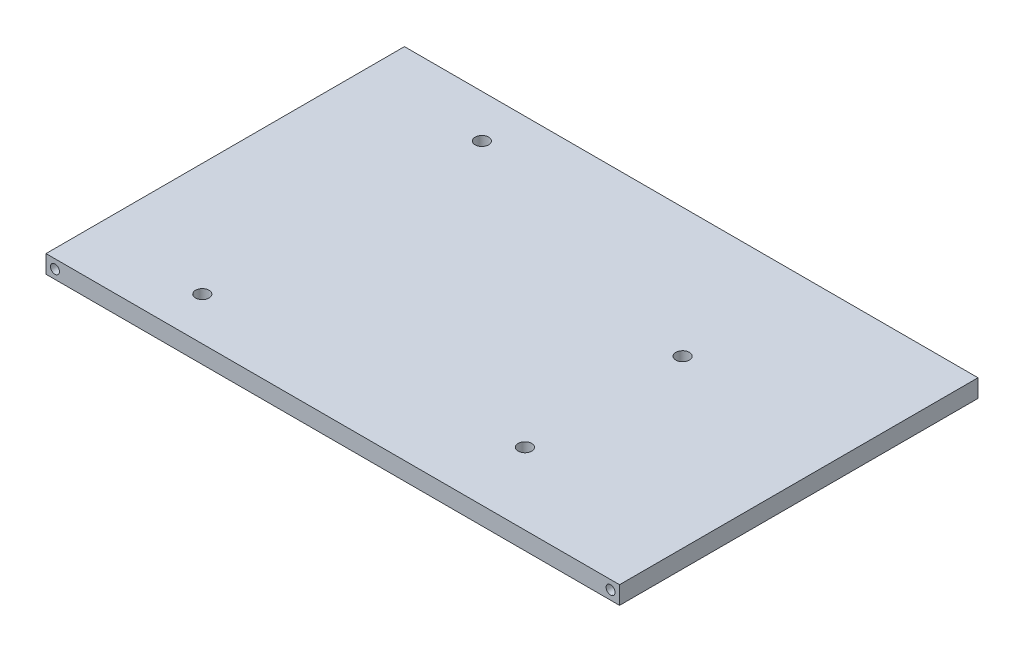
ISO-10303-21;
HEADER;
FILE_DESCRIPTION(('STEP AP214'),'2;1');
FILE_NAME('part.step','',(''),(''),'','','');
FILE_SCHEMA(('AUTOMOTIVE_DESIGN { 1 0 10303 214 1 1 1 1 }'));
ENDSEC;
DATA;
#1=APPLICATION_CONTEXT('core data for automotive mechanical design processes');
#2=APPLICATION_PROTOCOL_DEFINITION('international standard','automotive_design',2000,#1);
#3=PRODUCT_CONTEXT('',#1,'mechanical');
#4=PRODUCT('Part','Part','',(#3));
#5=PRODUCT_RELATED_PRODUCT_CATEGORY('part','',(#4));
#6=PRODUCT_DEFINITION_FORMATION('','',#4);
#7=PRODUCT_DEFINITION_CONTEXT('part definition',#1,'design');
#8=PRODUCT_DEFINITION('design','',#6,#7);
#9=PRODUCT_DEFINITION_SHAPE('','',#8);
#10=(LENGTH_UNIT() NAMED_UNIT(*) SI_UNIT(.MILLI.,.METRE.));
#11=(NAMED_UNIT(*) PLANE_ANGLE_UNIT() SI_UNIT($,.RADIAN.));
#12=(NAMED_UNIT(*) SI_UNIT($,.STERADIAN.) SOLID_ANGLE_UNIT());
#13=UNCERTAINTY_MEASURE_WITH_UNIT(LENGTH_MEASURE(1.E-05),#10,'distance_accuracy_value','');
#14=(GEOMETRIC_REPRESENTATION_CONTEXT(3) GLOBAL_UNCERTAINTY_ASSIGNED_CONTEXT((#13)) GLOBAL_UNIT_ASSIGNED_CONTEXT((#10,
#11,#12)) REPRESENTATION_CONTEXT('',''));
#15=CARTESIAN_POINT('',(0.,0.,0.));
#16=DIRECTION('',(0.,0.,1.));
#17=DIRECTION('',(1.,0.,0.));
#18=AXIS2_PLACEMENT_3D('',#15,#16,#17);
#19=CARTESIAN_POINT('',(-42.2044454578592,3.175,-20.6541242768741));
#20=DIRECTION('',(1.,0.,0.));
#21=DIRECTION('',(0.,0.,-1.));
#22=AXIS2_PLACEMENT_3D('',#19,#20,#21);
#23=PLANE('',#22);
#24=DIRECTION('',(0.,0.,1.));
#25=VECTOR('',#24,1.);
#26=CARTESIAN_POINT('',(-42.2044454578592,0.,-20.6541242768741));
#27=LINE('',#26,#25);
#28=CARTESIAN_POINT('',(-42.2044454578592,0.,-20.6541242768741));
#29=VERTEX_POINT('',#28);
#30=CARTESIAN_POINT('',(-42.2044454578592,0.,42.8458757231259));
#31=VERTEX_POINT('',#30);
#32=EDGE_CURVE('E95',#29,#31,#27,.T.);
#33=ORIENTED_EDGE('',*,*,#32,.T.);
#34=DIRECTION('',(0.,-1.,0.));
#35=VECTOR('',#34,1.);
#36=CARTESIAN_POINT('',(-42.2044454578592,3.175,42.8458757231259));
#37=LINE('',#36,#35);
#38=CARTESIAN_POINT('',(-42.2044454578592,3.175,42.8458757231259));
#39=VERTEX_POINT('',#38);
#40=EDGE_CURVE('E11',#39,#31,#37,.T.);
#41=ORIENTED_EDGE('',*,*,#40,.F.);
#42=DIRECTION('',(0.,0.,1.));
#43=VECTOR('',#42,1.);
#44=CARTESIAN_POINT('',(-42.2044454578592,3.175,-20.6541242768741));
#45=LINE('',#44,#43);
#46=CARTESIAN_POINT('',(-42.2044454578592,3.175,-20.6541242768741));
#47=VERTEX_POINT('',#46);
#48=EDGE_CURVE('E83',#47,#39,#45,.T.);
#49=ORIENTED_EDGE('',*,*,#48,.F.);
#50=DIRECTION('',(0.,-1.,0.));
#51=VECTOR('',#50,1.);
#52=CARTESIAN_POINT('',(-42.2044454578592,3.175,-20.6541242768741));
#53=LINE('',#52,#51);
#54=EDGE_CURVE('E91',#47,#29,#53,.T.);
#55=ORIENTED_EDGE('',*,*,#54,.T.);
#56=EDGE_LOOP('',(#33,#41,#49,#55));
#57=FACE_BOUND('',#56,.T.);
#58=ADVANCED_FACE('F32',(#57),#23,.F.);
#59=CARTESIAN_POINT('',(-42.2044454578592,3.175,42.8458757231259));
#60=DIRECTION('',(0.,0.,-1.));
#61=DIRECTION('',(-1.,0.,0.));
#62=AXIS2_PLACEMENT_3D('',#59,#60,#61);
#63=PLANE('',#62);
#64=CARTESIAN_POINT('',(57.8080545421408,1.5875,42.8458757231259));
#65=DIRECTION('',(0.,0.,1.));
#66=DIRECTION('',(1.,0.,0.));
#67=AXIS2_PLACEMENT_3D('',#64,#65,#66);
#68=CIRCLE('',#67,0.79375);
#69=CARTESIAN_POINT('',(58.6018045421408,1.5875,42.8458757231259));
#70=VERTEX_POINT('',#69);
#71=EDGE_CURVE('E115',#70,#70,#68,.T.);
#72=ORIENTED_EDGE('',*,*,#71,.F.);
#73=EDGE_LOOP('',(#72));
#74=FACE_BOUND('',#73,.T.);
#75=CARTESIAN_POINT('',(-40.6169454578592,1.5875,42.8458757231259));
#76=DIRECTION('',(0.,0.,1.));
#77=DIRECTION('',(1.,0.,0.));
#78=AXIS2_PLACEMENT_3D('',#75,#76,#77);
#79=CIRCLE('',#78,0.79375);
#80=CARTESIAN_POINT('',(-39.8231954578592,1.5875,42.8458757231259));
#81=VERTEX_POINT('',#80);
#82=EDGE_CURVE('E109',#81,#81,#79,.T.);
#83=ORIENTED_EDGE('',*,*,#82,.F.);
#84=EDGE_LOOP('',(#83));
#85=FACE_BOUND('',#84,.T.);
#86=DIRECTION('',(1.,0.,0.));
#87=VECTOR('',#86,1.);
#88=CARTESIAN_POINT('',(-42.2044454578592,0.,42.8458757231259));
#89=LINE('',#88,#87);
#90=CARTESIAN_POINT('',(59.3955545421408,0.,42.8458757231259));
#91=VERTEX_POINT('',#90);
#92=EDGE_CURVE('E87',#31,#91,#89,.T.);
#93=ORIENTED_EDGE('',*,*,#92,.T.);
#94=DIRECTION('',(0.,-1.,0.));
#95=VECTOR('',#94,1.);
#96=CARTESIAN_POINT('',(59.3955545421408,3.175,42.8458757231259));
#97=LINE('',#96,#95);
#98=CARTESIAN_POINT('',(59.3955545421408,3.175,42.8458757231259));
#99=VERTEX_POINT('',#98);
#100=EDGE_CURVE('E40',#99,#91,#97,.T.);
#101=ORIENTED_EDGE('',*,*,#100,.F.);
#102=DIRECTION('',(1.,0.,0.));
#103=VECTOR('',#102,1.);
#104=CARTESIAN_POINT('',(-42.2044454578592,3.175,42.8458757231259));
#105=LINE('',#104,#103);
#106=EDGE_CURVE('E78',#39,#99,#105,.T.);
#107=ORIENTED_EDGE('',*,*,#106,.F.);
#108=ORIENTED_EDGE('',*,*,#40,.T.);
#109=EDGE_LOOP('',(#93,#101,#107,#108));
#110=FACE_BOUND('',#109,.T.);
#111=ADVANCED_FACE('F86',(#74,#85,#110),#63,.F.);
#112=CARTESIAN_POINT('',(59.3955545421408,3.175,-20.6541242768741));
#113=DIRECTION('',(-1.,0.,0.));
#114=DIRECTION('',(0.,0.,1.));
#115=AXIS2_PLACEMENT_3D('',#112,#113,#114);
#116=PLANE('',#115);
#117=DIRECTION('',(0.,0.,-1.));
#118=VECTOR('',#117,1.);
#119=CARTESIAN_POINT('',(59.3955545421408,0.,-20.6541242768741));
#120=LINE('',#119,#118);
#121=CARTESIAN_POINT('',(59.3955545421408,0.,-20.6541242768741));
#122=VERTEX_POINT('',#121);
#123=EDGE_CURVE('E65',#91,#122,#120,.T.);
#124=ORIENTED_EDGE('',*,*,#123,.T.);
#125=DIRECTION('',(0.,-1.,0.));
#126=VECTOR('',#125,1.);
#127=CARTESIAN_POINT('',(59.3955545421408,3.175,-20.6541242768741));
#128=LINE('',#127,#126);
#129=CARTESIAN_POINT('',(59.3955545421408,3.175,-20.6541242768741));
#130=VERTEX_POINT('',#129);
#131=EDGE_CURVE('E88',#130,#122,#128,.T.);
#132=ORIENTED_EDGE('',*,*,#131,.F.);
#133=DIRECTION('',(0.,0.,-1.));
#134=VECTOR('',#133,1.);
#135=CARTESIAN_POINT('',(59.3955545421408,3.175,-20.6541242768741));
#136=LINE('',#135,#134);
#137=EDGE_CURVE('E81',#99,#130,#136,.T.);
#138=ORIENTED_EDGE('',*,*,#137,.F.);
#139=ORIENTED_EDGE('',*,*,#100,.T.);
#140=EDGE_LOOP('',(#124,#132,#138,#139));
#141=FACE_BOUND('',#140,.T.);
#142=ADVANCED_FACE('F89',(#141),#116,.F.);
#143=CARTESIAN_POINT('',(-42.2044454578592,3.175,-20.6541242768741));
#144=DIRECTION('',(0.,0.,1.));
#145=DIRECTION('',(1.,0.,0.));
#146=AXIS2_PLACEMENT_3D('',#143,#144,#145);
#147=PLANE('',#146);
#148=CARTESIAN_POINT('',(-40.6169454578592,1.5875,-20.6541242768741));
#149=DIRECTION('',(0.,0.,-1.));
#150=DIRECTION('',(-1.,0.,0.));
#151=AXIS2_PLACEMENT_3D('',#148,#149,#150);
#152=CIRCLE('',#151,0.79375);
#153=CARTESIAN_POINT('',(-41.4106954578592,1.5875,-20.6541242768741));
#154=VERTEX_POINT('',#153);
#155=EDGE_CURVE('E127',#154,#154,#152,.T.);
#156=ORIENTED_EDGE('',*,*,#155,.F.);
#157=EDGE_LOOP('',(#156));
#158=FACE_BOUND('',#157,.T.);
#159=CARTESIAN_POINT('',(57.8080545421408,1.5875,-20.6541242768741));
#160=DIRECTION('',(0.,0.,-1.));
#161=DIRECTION('',(-1.,0.,0.));
#162=AXIS2_PLACEMENT_3D('',#159,#160,#161);
#163=CIRCLE('',#162,0.79375);
#164=CARTESIAN_POINT('',(57.0143045421408,1.5875,-20.6541242768741));
#165=VERTEX_POINT('',#164);
#166=EDGE_CURVE('E121',#165,#165,#163,.T.);
#167=ORIENTED_EDGE('',*,*,#166,.F.);
#168=EDGE_LOOP('',(#167));
#169=FACE_BOUND('',#168,.T.);
#170=DIRECTION('',(-1.,0.,0.));
#171=VECTOR('',#170,1.);
#172=CARTESIAN_POINT('',(-42.2044454578592,0.,-20.6541242768741));
#173=LINE('',#172,#171);
#174=EDGE_CURVE('E71',#122,#29,#173,.T.);
#175=ORIENTED_EDGE('',*,*,#174,.T.);
#176=ORIENTED_EDGE('',*,*,#54,.F.);
#177=DIRECTION('',(-1.,0.,0.));
#178=VECTOR('',#177,1.);
#179=CARTESIAN_POINT('',(-42.2044454578592,3.175,-20.6541242768741));
#180=LINE('',#179,#178);
#181=EDGE_CURVE('E48',#130,#47,#180,.T.);
#182=ORIENTED_EDGE('',*,*,#181,.F.);
#183=ORIENTED_EDGE('',*,*,#131,.T.);
#184=EDGE_LOOP('',(#175,#176,#182,#183));
#185=FACE_BOUND('',#184,.T.);
#186=ADVANCED_FACE('F103',(#158,#169,#185),#147,.F.);
#187=CARTESIAN_POINT('',(0.,3.175,0.));
#188=DIRECTION('',(0.,1.,0.));
#189=DIRECTION('',(0.,0.,1.));
#190=AXIS2_PLACEMENT_3D('',#187,#188,#189);
#191=PLANE('',#190);
#192=CARTESIAN_POINT('',(29.9315545421408,3.175,30.1458757231259));
#193=DIRECTION('',(0.,1.,0.));
#194=DIRECTION('',(0.,0.,1.));
#195=AXIS2_PLACEMENT_3D('',#192,#193,#194);
#196=CIRCLE('',#195,1.19761);
#197=CARTESIAN_POINT('',(29.9315545421408,3.175,31.3434857231259));
#198=VERTEX_POINT('',#197);
#199=EDGE_CURVE('E151',#198,#198,#196,.T.);
#200=ORIENTED_EDGE('',*,*,#199,.F.);
#201=EDGE_LOOP('',(#200));
#202=FACE_BOUND('',#201,.T.);
#203=CARTESIAN_POINT('',(29.9315545421408,3.175,2.20587572312587));
#204=DIRECTION('',(0.,1.,0.));
#205=DIRECTION('',(0.,0.,1.));
#206=AXIS2_PLACEMENT_3D('',#203,#204,#205);
#207=CIRCLE('',#206,1.19761);
#208=CARTESIAN_POINT('',(29.9315545421408,3.175,3.40348572312587));
#209=VERTEX_POINT('',#208);
#210=EDGE_CURVE('E145',#209,#209,#207,.T.);
#211=ORIENTED_EDGE('',*,*,#210,.F.);
#212=EDGE_LOOP('',(#211));
#213=FACE_BOUND('',#212,.T.);
#214=CARTESIAN_POINT('',(-22.1384454578592,3.175,35.2258757231259));
#215=DIRECTION('',(0.,1.,0.));
#216=DIRECTION('',(0.,0.,1.));
#217=AXIS2_PLACEMENT_3D('',#214,#215,#216);
#218=CIRCLE('',#217,1.19761);
#219=CARTESIAN_POINT('',(-22.1384454578592,3.175,36.4234857231259));
#220=VERTEX_POINT('',#219);
#221=EDGE_CURVE('E139',#220,#220,#218,.T.);
#222=ORIENTED_EDGE('',*,*,#221,.F.);
#223=EDGE_LOOP('',(#222));
#224=FACE_BOUND('',#223,.T.);
#225=CARTESIAN_POINT('',(-20.8684454578592,3.175,-13.0341242768741));
#226=DIRECTION('',(0.,1.,0.));
#227=DIRECTION('',(0.,0.,1.));
#228=AXIS2_PLACEMENT_3D('',#225,#226,#227);
#229=CIRCLE('',#228,1.19761);
#230=CARTESIAN_POINT('',(-20.8684454578592,3.175,-11.8365142768741));
#231=VERTEX_POINT('',#230);
#232=EDGE_CURVE('E133',#231,#231,#229,.T.);
#233=ORIENTED_EDGE('',*,*,#232,.F.);
#234=EDGE_LOOP('',(#233));
#235=FACE_BOUND('',#234,.T.);
#236=ORIENTED_EDGE('',*,*,#48,.T.);
#237=ORIENTED_EDGE('',*,*,#106,.T.);
#238=ORIENTED_EDGE('',*,*,#137,.T.);
#239=ORIENTED_EDGE('',*,*,#181,.T.);
#240=EDGE_LOOP('',(#236,#237,#238,#239));
#241=FACE_BOUND('',#240,.T.);
#242=ADVANCED_FACE('F79',(#202,#213,#224,#235,#241),#191,.T.);
#243=CARTESIAN_POINT('',(0.,0.,0.));
#244=DIRECTION('',(0.,1.,0.));
#245=DIRECTION('',(0.,0.,1.));
#246=AXIS2_PLACEMENT_3D('',#243,#244,#245);
#247=PLANE('',#246);
#248=CARTESIAN_POINT('',(29.9315545421408,0.,30.1458757231259));
#249=DIRECTION('',(0.,1.,0.));
#250=DIRECTION('',(0.,0.,1.));
#251=AXIS2_PLACEMENT_3D('',#248,#249,#250);
#252=CIRCLE('',#251,1.19761);
#253=CARTESIAN_POINT('',(29.9315545421408,0.,31.3434857231259));
#254=VERTEX_POINT('',#253);
#255=EDGE_CURVE('E148',#254,#254,#252,.T.);
#256=ORIENTED_EDGE('',*,*,#255,.T.);
#257=EDGE_LOOP('',(#256));
#258=FACE_BOUND('',#257,.T.);
#259=CARTESIAN_POINT('',(29.9315545421408,0.,2.20587572312587));
#260=DIRECTION('',(0.,1.,0.));
#261=DIRECTION('',(0.,0.,1.));
#262=AXIS2_PLACEMENT_3D('',#259,#260,#261);
#263=CIRCLE('',#262,1.19761);
#264=CARTESIAN_POINT('',(29.9315545421408,0.,3.40348572312587));
#265=VERTEX_POINT('',#264);
#266=EDGE_CURVE('E142',#265,#265,#263,.T.);
#267=ORIENTED_EDGE('',*,*,#266,.T.);
#268=EDGE_LOOP('',(#267));
#269=FACE_BOUND('',#268,.T.);
#270=CARTESIAN_POINT('',(-22.1384454578592,0.,35.2258757231259));
#271=DIRECTION('',(0.,1.,0.));
#272=DIRECTION('',(0.,0.,1.));
#273=AXIS2_PLACEMENT_3D('',#270,#271,#272);
#274=CIRCLE('',#273,1.19761);
#275=CARTESIAN_POINT('',(-22.1384454578592,0.,36.4234857231259));
#276=VERTEX_POINT('',#275);
#277=EDGE_CURVE('E136',#276,#276,#274,.T.);
#278=ORIENTED_EDGE('',*,*,#277,.T.);
#279=EDGE_LOOP('',(#278));
#280=FACE_BOUND('',#279,.T.);
#281=CARTESIAN_POINT('',(-20.8684454578592,0.,-13.0341242768741));
#282=DIRECTION('',(0.,1.,0.));
#283=DIRECTION('',(0.,0.,1.));
#284=AXIS2_PLACEMENT_3D('',#281,#282,#283);
#285=CIRCLE('',#284,1.19761);
#286=CARTESIAN_POINT('',(-20.8684454578592,0.,-11.8365142768741));
#287=VERTEX_POINT('',#286);
#288=EDGE_CURVE('E130',#287,#287,#285,.T.);
#289=ORIENTED_EDGE('',*,*,#288,.T.);
#290=EDGE_LOOP('',(#289));
#291=FACE_BOUND('',#290,.T.);
#292=ORIENTED_EDGE('',*,*,#32,.F.);
#293=ORIENTED_EDGE('',*,*,#174,.F.);
#294=ORIENTED_EDGE('',*,*,#123,.F.);
#295=ORIENTED_EDGE('',*,*,#92,.F.);
#296=EDGE_LOOP('',(#292,#293,#294,#295));
#297=FACE_BOUND('',#296,.T.);
#298=ADVANCED_FACE('F106',(#258,#269,#280,#291,#297),#247,.F.);
#299=CARTESIAN_POINT('',(-40.6169454578592,1.5875,36.4958757231259));
#300=DIRECTION('',(0.,0.,1.));
#301=DIRECTION('',(1.,0.,0.));
#302=AXIS2_PLACEMENT_3D('',#299,#300,#301);
#303=CYLINDRICAL_SURFACE('',#302,0.79375);
#304=CARTESIAN_POINT('',(-40.6169454578592,1.5875,36.4958757231259));
#305=DIRECTION('',(0.,0.,1.));
#306=DIRECTION('',(1.,0.,0.));
#307=AXIS2_PLACEMENT_3D('',#304,#305,#306);
#308=CIRCLE('',#307,0.79375);
#309=CARTESIAN_POINT('',(-39.8231954578592,1.5875,36.4958757231259));
#310=VERTEX_POINT('',#309);
#311=EDGE_CURVE('E98',#310,#310,#308,.T.);
#312=ORIENTED_EDGE('',*,*,#311,.F.);
#313=EDGE_LOOP('',(#312));
#314=FACE_BOUND('',#313,.T.);
#315=ORIENTED_EDGE('',*,*,#82,.T.);
#316=EDGE_LOOP('',(#315));
#317=FACE_BOUND('',#316,.T.);
#318=ADVANCED_FACE('F207',(#314,#317),#303,.F.);
#319=CARTESIAN_POINT('',(-40.6169454578592,1.5875,36.4958757231259));
#320=DIRECTION('',(0.,0.,1.));
#321=DIRECTION('',(1.,0.,0.));
#322=AXIS2_PLACEMENT_3D('',#319,#320,#321);
#323=PLANE('',#322);
#324=ORIENTED_EDGE('',*,*,#311,.T.);
#325=EDGE_LOOP('',(#324));
#326=FACE_BOUND('',#325,.T.);
#327=ADVANCED_FACE('F211',(#326),#323,.T.);
#328=CARTESIAN_POINT('',(57.8080545421408,1.5875,36.4958757231259));
#329=DIRECTION('',(0.,0.,1.));
#330=DIRECTION('',(1.,0.,0.));
#331=AXIS2_PLACEMENT_3D('',#328,#329,#330);
#332=CYLINDRICAL_SURFACE('',#331,0.79375);
#333=CARTESIAN_POINT('',(57.8080545421408,1.5875,36.4958757231259));
#334=DIRECTION('',(0.,0.,1.));
#335=DIRECTION('',(1.,0.,0.));
#336=AXIS2_PLACEMENT_3D('',#333,#334,#335);
#337=CIRCLE('',#336,0.79375);
#338=CARTESIAN_POINT('',(58.6018045421408,1.5875,36.4958757231259));
#339=VERTEX_POINT('',#338);
#340=EDGE_CURVE('E112',#339,#339,#337,.T.);
#341=ORIENTED_EDGE('',*,*,#340,.F.);
#342=EDGE_LOOP('',(#341));
#343=FACE_BOUND('',#342,.T.);
#344=ORIENTED_EDGE('',*,*,#71,.T.);
#345=EDGE_LOOP('',(#344));
#346=FACE_BOUND('',#345,.T.);
#347=ADVANCED_FACE('F215',(#343,#346),#332,.F.);
#348=CARTESIAN_POINT('',(57.8080545421408,1.5875,36.4958757231259));
#349=DIRECTION('',(0.,0.,1.));
#350=DIRECTION('',(1.,0.,0.));
#351=AXIS2_PLACEMENT_3D('',#348,#349,#350);
#352=PLANE('',#351);
#353=ORIENTED_EDGE('',*,*,#340,.T.);
#354=EDGE_LOOP('',(#353));
#355=FACE_BOUND('',#354,.T.);
#356=ADVANCED_FACE('F219',(#355),#352,.T.);
#357=CARTESIAN_POINT('',(57.8080545421408,1.5875,-14.3041242768741));
#358=DIRECTION('',(0.,0.,-1.));
#359=DIRECTION('',(-1.,0.,0.));
#360=AXIS2_PLACEMENT_3D('',#357,#358,#359);
#361=CYLINDRICAL_SURFACE('',#360,0.79375);
#362=CARTESIAN_POINT('',(57.8080545421408,1.5875,-14.3041242768741));
#363=DIRECTION('',(0.,0.,-1.));
#364=DIRECTION('',(-1.,0.,0.));
#365=AXIS2_PLACEMENT_3D('',#362,#363,#364);
#366=CIRCLE('',#365,0.79375);
#367=CARTESIAN_POINT('',(57.0143045421408,1.5875,-14.3041242768741));
#368=VERTEX_POINT('',#367);
#369=EDGE_CURVE('E118',#368,#368,#366,.T.);
#370=ORIENTED_EDGE('',*,*,#369,.F.);
#371=EDGE_LOOP('',(#370));
#372=FACE_BOUND('',#371,.T.);
#373=ORIENTED_EDGE('',*,*,#166,.T.);
#374=EDGE_LOOP('',(#373));
#375=FACE_BOUND('',#374,.T.);
#376=ADVANCED_FACE('F223',(#372,#375),#361,.F.);
#377=CARTESIAN_POINT('',(57.8080545421408,1.5875,-14.3041242768741));
#378=DIRECTION('',(0.,0.,-1.));
#379=DIRECTION('',(-1.,0.,0.));
#380=AXIS2_PLACEMENT_3D('',#377,#378,#379);
#381=PLANE('',#380);
#382=ORIENTED_EDGE('',*,*,#369,.T.);
#383=EDGE_LOOP('',(#382));
#384=FACE_BOUND('',#383,.T.);
#385=ADVANCED_FACE('F227',(#384),#381,.T.);
#386=CARTESIAN_POINT('',(-40.6169454578592,1.5875,-14.3041242768741));
#387=DIRECTION('',(0.,0.,-1.));
#388=DIRECTION('',(-1.,0.,0.));
#389=AXIS2_PLACEMENT_3D('',#386,#387,#388);
#390=CYLINDRICAL_SURFACE('',#389,0.79375);
#391=CARTESIAN_POINT('',(-40.6169454578592,1.5875,-14.3041242768741));
#392=DIRECTION('',(0.,0.,-1.));
#393=DIRECTION('',(-1.,0.,0.));
#394=AXIS2_PLACEMENT_3D('',#391,#392,#393);
#395=CIRCLE('',#394,0.79375);
#396=CARTESIAN_POINT('',(-41.4106954578592,1.5875,-14.3041242768741));
#397=VERTEX_POINT('',#396);
#398=EDGE_CURVE('E124',#397,#397,#395,.T.);
#399=ORIENTED_EDGE('',*,*,#398,.F.);
#400=EDGE_LOOP('',(#399));
#401=FACE_BOUND('',#400,.T.);
#402=ORIENTED_EDGE('',*,*,#155,.T.);
#403=EDGE_LOOP('',(#402));
#404=FACE_BOUND('',#403,.T.);
#405=ADVANCED_FACE('F187',(#401,#404),#390,.F.);
#406=CARTESIAN_POINT('',(-40.6169454578592,1.5875,-14.3041242768741));
#407=DIRECTION('',(0.,0.,-1.));
#408=DIRECTION('',(-1.,0.,0.));
#409=AXIS2_PLACEMENT_3D('',#406,#407,#408);
#410=PLANE('',#409);
#411=ORIENTED_EDGE('',*,*,#398,.T.);
#412=EDGE_LOOP('',(#411));
#413=FACE_BOUND('',#412,.T.);
#414=ADVANCED_FACE('F178',(#413),#410,.T.);
#415=CARTESIAN_POINT('',(-20.8684454578592,0.,-13.0341242768741));
#416=DIRECTION('',(0.,1.,0.));
#417=DIRECTION('',(0.,0.,1.));
#418=AXIS2_PLACEMENT_3D('',#415,#416,#417);
#419=CYLINDRICAL_SURFACE('',#418,1.19761);
#420=ORIENTED_EDGE('',*,*,#288,.F.);
#421=EDGE_LOOP('',(#420));
#422=FACE_BOUND('',#421,.T.);
#423=ORIENTED_EDGE('',*,*,#232,.T.);
#424=EDGE_LOOP('',(#423));
#425=FACE_BOUND('',#424,.T.);
#426=ADVANCED_FACE('F175',(#422,#425),#419,.F.);
#427=CARTESIAN_POINT('',(-22.1384454578592,0.,35.2258757231259));
#428=DIRECTION('',(0.,1.,0.));
#429=DIRECTION('',(0.,0.,1.));
#430=AXIS2_PLACEMENT_3D('',#427,#428,#429);
#431=CYLINDRICAL_SURFACE('',#430,1.19761);
#432=ORIENTED_EDGE('',*,*,#277,.F.);
#433=EDGE_LOOP('',(#432));
#434=FACE_BOUND('',#433,.T.);
#435=ORIENTED_EDGE('',*,*,#221,.T.);
#436=EDGE_LOOP('',(#435));
#437=FACE_BOUND('',#436,.T.);
#438=ADVANCED_FACE('F177',(#434,#437),#431,.F.);
#439=CARTESIAN_POINT('',(29.9315545421408,0.,2.20587572312587));
#440=DIRECTION('',(0.,1.,0.));
#441=DIRECTION('',(0.,0.,1.));
#442=AXIS2_PLACEMENT_3D('',#439,#440,#441);
#443=CYLINDRICAL_SURFACE('',#442,1.19761);
#444=ORIENTED_EDGE('',*,*,#266,.F.);
#445=EDGE_LOOP('',(#444));
#446=FACE_BOUND('',#445,.T.);
#447=ORIENTED_EDGE('',*,*,#210,.T.);
#448=EDGE_LOOP('',(#447));
#449=FACE_BOUND('',#448,.T.);
#450=ADVANCED_FACE('F162',(#446,#449),#443,.F.);
#451=CARTESIAN_POINT('',(29.9315545421408,0.,30.1458757231259));
#452=DIRECTION('',(0.,1.,0.));
#453=DIRECTION('',(0.,0.,1.));
#454=AXIS2_PLACEMENT_3D('',#451,#452,#453);
#455=CYLINDRICAL_SURFACE('',#454,1.19761);
#456=ORIENTED_EDGE('',*,*,#255,.F.);
#457=EDGE_LOOP('',(#456));
#458=FACE_BOUND('',#457,.T.);
#459=ORIENTED_EDGE('',*,*,#199,.T.);
#460=EDGE_LOOP('',(#459));
#461=FACE_BOUND('',#460,.T.);
#462=ADVANCED_FACE('F159',(#458,#461),#455,.F.);
#463=CLOSED_SHELL('',(#58,#111,#142,#186,#242,#298,#318,#327,#347,#356,#376,#385,#405,#414,#426,
#438,#450,#462));
#464=MANIFOLD_SOLID_BREP('B2',#463);
#465=ADVANCED_BREP_SHAPE_REPRESENTATION('',(#18,#464),#14);
#466=SHAPE_DEFINITION_REPRESENTATION(#9,#465);
ENDSEC;
END-ISO-10303-21;
